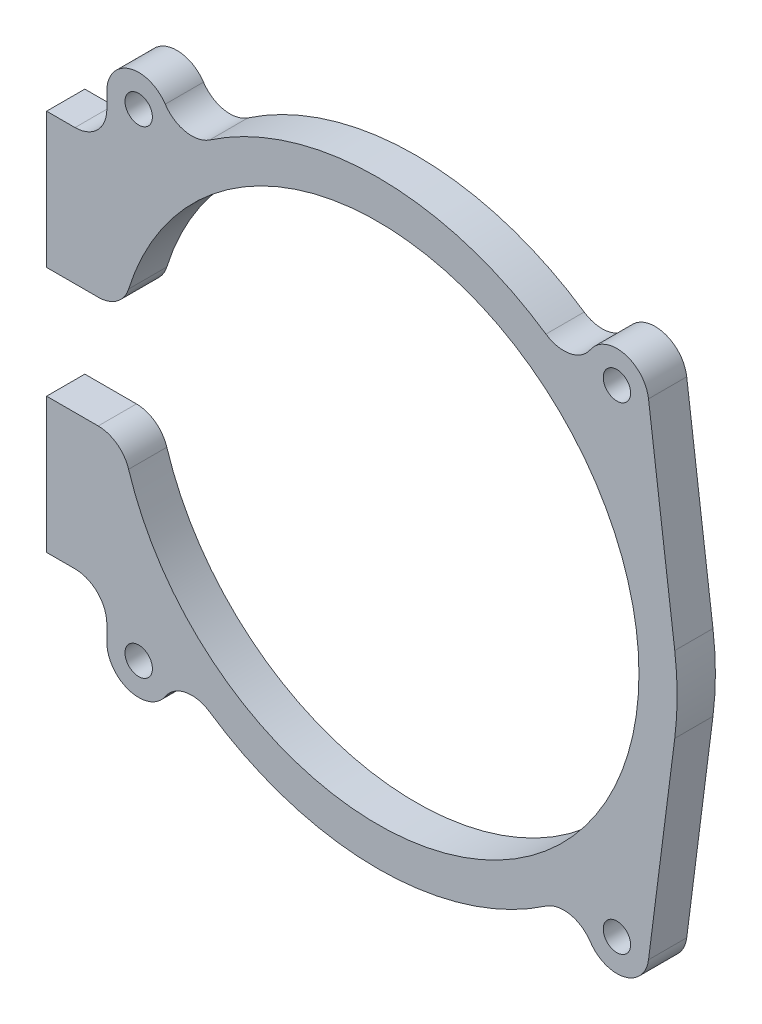
ISO-10303-21;
HEADER;
FILE_DESCRIPTION(('STEP AP214'),'2;1');
FILE_NAME('part.step','',(''),(''),'','','');
FILE_SCHEMA(('AUTOMOTIVE_DESIGN { 1 0 10303 214 1 1 1 1 }'));
ENDSEC;
DATA;
#1=APPLICATION_CONTEXT('core data for automotive mechanical design processes');
#2=APPLICATION_PROTOCOL_DEFINITION('international standard','automotive_design',2000,#1);
#3=PRODUCT_CONTEXT('',#1,'mechanical');
#4=PRODUCT('Part','Part','',(#3));
#5=PRODUCT_RELATED_PRODUCT_CATEGORY('part','',(#4));
#6=PRODUCT_DEFINITION_FORMATION('','',#4);
#7=PRODUCT_DEFINITION_CONTEXT('part definition',#1,'design');
#8=PRODUCT_DEFINITION('design','',#6,#7);
#9=PRODUCT_DEFINITION_SHAPE('','',#8);
#10=(LENGTH_UNIT() NAMED_UNIT(*) SI_UNIT(.MILLI.,.METRE.));
#11=(NAMED_UNIT(*) PLANE_ANGLE_UNIT() SI_UNIT($,.RADIAN.));
#12=(NAMED_UNIT(*) SI_UNIT($,.STERADIAN.) SOLID_ANGLE_UNIT());
#13=UNCERTAINTY_MEASURE_WITH_UNIT(LENGTH_MEASURE(1.E-05),#10,'distance_accuracy_value','');
#14=(GEOMETRIC_REPRESENTATION_CONTEXT(3) GLOBAL_UNCERTAINTY_ASSIGNED_CONTEXT((#13)) GLOBAL_UNIT_ASSIGNED_CONTEXT((#10,
#11,#12)) REPRESENTATION_CONTEXT('',''));
#15=CARTESIAN_POINT('',(0.,0.,0.));
#16=DIRECTION('',(0.,0.,1.));
#17=DIRECTION('',(1.,0.,0.));
#18=AXIS2_PLACEMENT_3D('',#15,#16,#17);
#19=CARTESIAN_POINT('',(-43.8968962456345,-13.75,6.));
#20=DIRECTION('',(0.,0.,-1.));
#21=DIRECTION('',(-1.,0.,0.));
#22=AXIS2_PLACEMENT_3D('',#19,#20,#21);
#23=CYLINDRICAL_SURFACE('',#22,5.);
#24=CARTESIAN_POINT('',(-43.8968962456345,-13.75,0.));
#25=DIRECTION('',(0.,0.,1.));
#26=DIRECTION('',(1.,0.,0.));
#27=AXIS2_PLACEMENT_3D('',#24,#25,#26);
#28=CIRCLE('',#27,5.);
#29=CARTESIAN_POINT('',(-43.8968962456345,-8.75,0.));
#30=VERTEX_POINT('',#29);
#31=CARTESIAN_POINT('',(-39.1254944798047,-12.2554347826087,0.));
#32=VERTEX_POINT('',#31);
#33=EDGE_CURVE('E249',#30,#32,#28,.F.);
#34=ORIENTED_EDGE('',*,*,#33,.F.);
#35=DIRECTION('',(0.,0.,-1.));
#36=VECTOR('',#35,1.);
#37=CARTESIAN_POINT('',(-43.8968962456345,-8.75,6.));
#38=LINE('',#37,#36);
#39=CARTESIAN_POINT('',(-43.8968962456345,-8.75,6.));
#40=VERTEX_POINT('',#39);
#41=EDGE_CURVE('E11',#40,#30,#38,.T.);
#42=ORIENTED_EDGE('',*,*,#41,.F.);
#43=CARTESIAN_POINT('',(-43.8968962456345,-13.75,6.));
#44=DIRECTION('',(0.,0.,1.));
#45=DIRECTION('',(1.,0.,0.));
#46=AXIS2_PLACEMENT_3D('',#43,#44,#45);
#47=CIRCLE('',#46,5.);
#48=CARTESIAN_POINT('',(-39.1254944798047,-12.2554347826087,6.));
#49=VERTEX_POINT('',#48);
#50=EDGE_CURVE('E326',#40,#49,#47,.F.);
#51=ORIENTED_EDGE('',*,*,#50,.T.);
#52=DIRECTION('',(0.,0.,-1.));
#53=VECTOR('',#52,1.);
#54=CARTESIAN_POINT('',(-39.1254944798047,-12.2554347826087,6.));
#55=LINE('',#54,#53);
#56=EDGE_CURVE('E52',#49,#32,#55,.T.);
#57=ORIENTED_EDGE('',*,*,#56,.T.);
#58=EDGE_LOOP('',(#34,#42,#51,#57));
#59=FACE_BOUND('',#58,.T.);
#60=ADVANCED_FACE('F36',(#59),#23,.T.);
#61=CARTESIAN_POINT('',(0.,-8.75,6.));
#62=DIRECTION('',(0.,1.,0.));
#63=DIRECTION('',(0.,0.,1.));
#64=AXIS2_PLACEMENT_3D('',#61,#62,#63);
#65=PLANE('',#64);
#66=DIRECTION('',(1.,0.,0.));
#67=VECTOR('',#66,1.);
#68=CARTESIAN_POINT('',(0.,-8.75,0.));
#69=LINE('',#68,#67);
#70=CARTESIAN_POINT('',(-52.,-8.75,0.));
#71=VERTEX_POINT('',#70);
#72=EDGE_CURVE('E251',#71,#30,#69,.T.);
#73=ORIENTED_EDGE('',*,*,#72,.F.);
#74=DIRECTION('',(0.,0.,-1.));
#75=VECTOR('',#74,1.);
#76=CARTESIAN_POINT('',(-52.,-8.75,6.));
#77=LINE('',#76,#75);
#78=CARTESIAN_POINT('',(-52.,-8.75,6.));
#79=VERTEX_POINT('',#78);
#80=EDGE_CURVE('E44',#79,#71,#77,.T.);
#81=ORIENTED_EDGE('',*,*,#80,.F.);
#82=DIRECTION('',(1.,0.,0.));
#83=VECTOR('',#82,1.);
#84=CARTESIAN_POINT('',(0.,-8.75,6.));
#85=LINE('',#84,#83);
#86=EDGE_CURVE('E394',#79,#40,#85,.T.);
#87=ORIENTED_EDGE('',*,*,#86,.T.);
#88=ORIENTED_EDGE('',*,*,#41,.T.);
#89=EDGE_LOOP('',(#73,#81,#87,#88));
#90=FACE_BOUND('',#89,.T.);
#91=ADVANCED_FACE('F393',(#90),#65,.T.);
#92=CARTESIAN_POINT('',(-52.,0.,6.));
#93=DIRECTION('',(1.,0.,0.));
#94=DIRECTION('',(0.,0.,-1.));
#95=AXIS2_PLACEMENT_3D('',#92,#93,#94);
#96=PLANE('',#95);
#97=DIRECTION('',(0.,-1.,0.));
#98=VECTOR('',#97,1.);
#99=CARTESIAN_POINT('',(-52.,0.,0.));
#100=LINE('',#99,#98);
#101=CARTESIAN_POINT('',(-52.,-30.,0.));
#102=VERTEX_POINT('',#101);
#103=EDGE_CURVE('E254',#71,#102,#100,.T.);
#104=ORIENTED_EDGE('',*,*,#103,.T.);
#105=DIRECTION('',(0.,0.,-1.));
#106=VECTOR('',#105,1.);
#107=CARTESIAN_POINT('',(-52.,-30.,6.));
#108=LINE('',#107,#106);
#109=CARTESIAN_POINT('',(-52.,-30.,6.));
#110=VERTEX_POINT('',#109);
#111=EDGE_CURVE('E377',#110,#102,#108,.T.);
#112=ORIENTED_EDGE('',*,*,#111,.F.);
#113=DIRECTION('',(0.,-1.,0.));
#114=VECTOR('',#113,1.);
#115=CARTESIAN_POINT('',(-52.,0.,6.));
#116=LINE('',#115,#114);
#117=EDGE_CURVE('E383',#79,#110,#116,.T.);
#118=ORIENTED_EDGE('',*,*,#117,.F.);
#119=ORIENTED_EDGE('',*,*,#80,.T.);
#120=EDGE_LOOP('',(#104,#112,#118,#119));
#121=FACE_BOUND('',#120,.T.);
#122=ADVANCED_FACE('F381',(#121),#96,.F.);
#123=CARTESIAN_POINT('',(0.,-30.,6.));
#124=DIRECTION('',(0.,-1.,0.));
#125=DIRECTION('',(0.,0.,-1.));
#126=AXIS2_PLACEMENT_3D('',#123,#124,#125);
#127=PLANE('',#126);
#128=DIRECTION('',(-1.,0.,0.));
#129=VECTOR('',#128,1.);
#130=CARTESIAN_POINT('',(0.,-30.,0.));
#131=LINE('',#130,#129);
#132=CARTESIAN_POINT('',(-47.54,-30.,0.));
#133=VERTEX_POINT('',#132);
#134=EDGE_CURVE('E257',#133,#102,#131,.T.);
#135=ORIENTED_EDGE('',*,*,#134,.F.);
#136=DIRECTION('',(0.,0.,-1.));
#137=VECTOR('',#136,1.);
#138=CARTESIAN_POINT('',(-47.54,-30.,6.));
#139=LINE('',#138,#137);
#140=CARTESIAN_POINT('',(-47.54,-30.,6.));
#141=VERTEX_POINT('',#140);
#142=EDGE_CURVE('E375',#141,#133,#139,.T.);
#143=ORIENTED_EDGE('',*,*,#142,.F.);
#144=DIRECTION('',(-1.,0.,0.));
#145=VECTOR('',#144,1.);
#146=CARTESIAN_POINT('',(0.,-30.,6.));
#147=LINE('',#146,#145);
#148=EDGE_CURVE('E786',#141,#110,#147,.T.);
#149=ORIENTED_EDGE('',*,*,#148,.T.);
#150=ORIENTED_EDGE('',*,*,#111,.T.);
#151=EDGE_LOOP('',(#135,#143,#149,#150));
#152=FACE_BOUND('',#151,.T.);
#153=ADVANCED_FACE('F417',(#152),#127,.T.);
#154=CARTESIAN_POINT('',(-47.54,-35.,6.));
#155=DIRECTION('',(0.,0.,-1.));
#156=DIRECTION('',(-1.,0.,0.));
#157=AXIS2_PLACEMENT_3D('',#154,#155,#156);
#158=CYLINDRICAL_SURFACE('',#157,5.);
#159=CARTESIAN_POINT('',(-47.54,-35.,0.));
#160=DIRECTION('',(0.,0.,1.));
#161=DIRECTION('',(1.,0.,0.));
#162=AXIS2_PLACEMENT_3D('',#159,#160,#161);
#163=CIRCLE('',#162,5.);
#164=CARTESIAN_POINT('',(-42.54,-35.,0.));
#165=VERTEX_POINT('',#164);
#166=EDGE_CURVE('E260',#133,#165,#163,.F.);
#167=ORIENTED_EDGE('',*,*,#166,.T.);
#168=DIRECTION('',(0.,0.,-1.));
#169=VECTOR('',#168,1.);
#170=CARTESIAN_POINT('',(-42.54,-35.,6.));
#171=LINE('',#170,#169);
#172=CARTESIAN_POINT('',(-42.54,-35.,6.));
#173=VERTEX_POINT('',#172);
#174=EDGE_CURVE('E373',#173,#165,#171,.T.);
#175=ORIENTED_EDGE('',*,*,#174,.F.);
#176=CARTESIAN_POINT('',(-47.54,-35.,6.));
#177=DIRECTION('',(0.,0.,1.));
#178=DIRECTION('',(1.,0.,0.));
#179=AXIS2_PLACEMENT_3D('',#176,#177,#178);
#180=CIRCLE('',#179,5.);
#181=EDGE_CURVE('E787',#141,#173,#180,.F.);
#182=ORIENTED_EDGE('',*,*,#181,.F.);
#183=ORIENTED_EDGE('',*,*,#142,.T.);
#184=EDGE_LOOP('',(#167,#175,#182,#183));
#185=FACE_BOUND('',#184,.T.);
#186=ADVANCED_FACE('F422',(#185),#158,.F.);
#187=CARTESIAN_POINT('',(-42.54,0.,6.));
#188=DIRECTION('',(-1.,0.,0.));
#189=DIRECTION('',(0.,0.,1.));
#190=AXIS2_PLACEMENT_3D('',#187,#188,#189);
#191=PLANE('',#190);
#192=DIRECTION('',(0.,1.,0.));
#193=VECTOR('',#192,1.);
#194=CARTESIAN_POINT('',(-42.54,0.,0.));
#195=LINE('',#194,#193);
#196=CARTESIAN_POINT('',(-42.54,-37.5,0.));
#197=VERTEX_POINT('',#196);
#198=EDGE_CURVE('E263',#197,#165,#195,.T.);
#199=ORIENTED_EDGE('',*,*,#198,.F.);
#200=DIRECTION('',(0.,0.,-1.));
#201=VECTOR('',#200,1.);
#202=CARTESIAN_POINT('',(-42.54,-37.5,6.));
#203=LINE('',#202,#201);
#204=CARTESIAN_POINT('',(-42.54,-37.5,6.));
#205=VERTEX_POINT('',#204);
#206=EDGE_CURVE('E371',#205,#197,#203,.T.);
#207=ORIENTED_EDGE('',*,*,#206,.F.);
#208=DIRECTION('',(0.,1.,0.));
#209=VECTOR('',#208,1.);
#210=CARTESIAN_POINT('',(-42.54,0.,6.));
#211=LINE('',#210,#209);
#212=EDGE_CURVE('E781',#205,#173,#211,.T.);
#213=ORIENTED_EDGE('',*,*,#212,.T.);
#214=ORIENTED_EDGE('',*,*,#174,.T.);
#215=EDGE_LOOP('',(#199,#207,#213,#214));
#216=FACE_BOUND('',#215,.T.);
#217=ADVANCED_FACE('F426',(#216),#191,.T.);
#218=CARTESIAN_POINT('',(-37.54,-37.5,6.));
#219=DIRECTION('',(0.,0.,-1.));
#220=DIRECTION('',(-1.,0.,0.));
#221=AXIS2_PLACEMENT_3D('',#218,#219,#220);
#222=CYLINDRICAL_SURFACE('',#221,5.);
#223=CARTESIAN_POINT('',(-37.54,-37.5,0.));
#224=DIRECTION('',(0.,0.,1.));
#225=DIRECTION('',(1.,0.,0.));
#226=AXIS2_PLACEMENT_3D('',#223,#224,#225);
#227=CIRCLE('',#226,5.);
#228=CARTESIAN_POINT('',(-33.3722359848189,-40.262198963464,0.));
#229=VERTEX_POINT('',#228);
#230=EDGE_CURVE('E266',#197,#229,#227,.T.);
#231=ORIENTED_EDGE('',*,*,#230,.T.);
#232=DIRECTION('',(0.,0.,-1.));
#233=VECTOR('',#232,1.);
#234=CARTESIAN_POINT('',(-33.3722359848189,-40.262198963464,6.));
#235=LINE('',#234,#233);
#236=CARTESIAN_POINT('',(-33.3722359848189,-40.262198963464,6.));
#237=VERTEX_POINT('',#236);
#238=EDGE_CURVE('E368',#237,#229,#235,.T.);
#239=ORIENTED_EDGE('',*,*,#238,.F.);
#240=CARTESIAN_POINT('',(-37.54,-37.5,6.));
#241=DIRECTION('',(0.,0.,1.));
#242=DIRECTION('',(1.,0.,0.));
#243=AXIS2_PLACEMENT_3D('',#240,#241,#242);
#244=CIRCLE('',#243,5.);
#245=EDGE_CURVE('E778',#205,#237,#244,.T.);
#246=ORIENTED_EDGE('',*,*,#245,.F.);
#247=ORIENTED_EDGE('',*,*,#206,.T.);
#248=EDGE_LOOP('',(#231,#239,#246,#247));
#249=FACE_BOUND('',#248,.T.);
#250=ADVANCED_FACE('F430',(#249),#222,.T.);
#251=CARTESIAN_POINT('',(-29.2044719696378,-43.0243979269279,6.));
#252=DIRECTION('',(0.,0.,-1.));
#253=DIRECTION('',(-1.,0.,0.));
#254=AXIS2_PLACEMENT_3D('',#251,#252,#253);
#255=CYLINDRICAL_SURFACE('',#254,5.);
#256=CARTESIAN_POINT('',(-29.2044719696378,-43.0243979269279,0.));
#257=DIRECTION('',(0.,0.,1.));
#258=DIRECTION('',(1.,0.,0.));
#259=AXIS2_PLACEMENT_3D('',#256,#257,#258);
#260=CIRCLE('',#259,5.);
#261=CARTESIAN_POINT('',(-26.3963496648649,-38.8874365878002,0.));
#262=VERTEX_POINT('',#261);
#263=EDGE_CURVE('E268',#229,#262,#260,.F.);
#264=ORIENTED_EDGE('',*,*,#263,.T.);
#265=DIRECTION('',(0.,0.,-1.));
#266=VECTOR('',#265,1.);
#267=CARTESIAN_POINT('',(-26.3963496648649,-38.8874365878002,6.));
#268=LINE('',#267,#266);
#269=CARTESIAN_POINT('',(-26.3963496648649,-38.8874365878002,6.));
#270=VERTEX_POINT('',#269);
#271=EDGE_CURVE('E365',#270,#262,#268,.T.);
#272=ORIENTED_EDGE('',*,*,#271,.F.);
#273=CARTESIAN_POINT('',(-29.2044719696378,-43.0243979269279,6.));
#274=DIRECTION('',(0.,0.,1.));
#275=DIRECTION('',(1.,0.,0.));
#276=AXIS2_PLACEMENT_3D('',#273,#274,#275);
#277=CIRCLE('',#276,5.);
#278=EDGE_CURVE('E776',#237,#270,#277,.F.);
#279=ORIENTED_EDGE('',*,*,#278,.F.);
#280=ORIENTED_EDGE('',*,*,#238,.T.);
#281=EDGE_LOOP('',(#264,#272,#279,#280));
#282=FACE_BOUND('',#281,.T.);
#283=ADVANCED_FACE('F434',(#282),#255,.F.);
#284=CARTESIAN_POINT('',(0.,0.,6.));
#285=DIRECTION('',(0.,0.,-1.));
#286=DIRECTION('',(-1.,0.,0.));
#287=AXIS2_PLACEMENT_3D('',#284,#285,#286);
#288=CYLINDRICAL_SURFACE('',#287,47.);
#289=CARTESIAN_POINT('',(0.,0.,0.));
#290=DIRECTION('',(0.,0.,1.));
#291=DIRECTION('',(1.,0.,0.));
#292=AXIS2_PLACEMENT_3D('',#289,#290,#291);
#293=CIRCLE('',#292,47.);
#294=CARTESIAN_POINT('',(26.3963496648649,-38.8874365878002,0.));
#295=VERTEX_POINT('',#294);
#296=EDGE_CURVE('E270',#262,#295,#293,.T.);
#297=ORIENTED_EDGE('',*,*,#296,.T.);
#298=DIRECTION('',(0.,0.,-1.));
#299=VECTOR('',#298,1.);
#300=CARTESIAN_POINT('',(26.3963496648649,-38.8874365878002,6.));
#301=LINE('',#300,#299);
#302=CARTESIAN_POINT('',(26.3963496648649,-38.8874365878002,6.));
#303=VERTEX_POINT('',#302);
#304=EDGE_CURVE('E363',#303,#295,#301,.T.);
#305=ORIENTED_EDGE('',*,*,#304,.F.);
#306=CARTESIAN_POINT('',(0.,0.,6.));
#307=DIRECTION('',(0.,0.,1.));
#308=DIRECTION('',(1.,0.,0.));
#309=AXIS2_PLACEMENT_3D('',#306,#307,#308);
#310=CIRCLE('',#309,47.);
#311=EDGE_CURVE('E796',#270,#303,#310,.T.);
#312=ORIENTED_EDGE('',*,*,#311,.F.);
#313=ORIENTED_EDGE('',*,*,#271,.T.);
#314=EDGE_LOOP('',(#297,#305,#312,#313));
#315=FACE_BOUND('',#314,.T.);
#316=ADVANCED_FACE('F438',(#315),#288,.T.);
#317=CARTESIAN_POINT('',(29.2044719696378,-43.0243979269279,6.));
#318=DIRECTION('',(0.,0.,-1.));
#319=DIRECTION('',(-1.,0.,0.));
#320=AXIS2_PLACEMENT_3D('',#317,#318,#319);
#321=CYLINDRICAL_SURFACE('',#320,5.);
#322=CARTESIAN_POINT('',(29.2044719696378,-43.0243979269279,0.));
#323=DIRECTION('',(0.,0.,1.));
#324=DIRECTION('',(1.,0.,0.));
#325=AXIS2_PLACEMENT_3D('',#322,#323,#324);
#326=CIRCLE('',#325,5.);
#327=CARTESIAN_POINT('',(33.3722359848189,-40.262198963464,0.));
#328=VERTEX_POINT('',#327);
#329=EDGE_CURVE('E273',#328,#295,#326,.T.);
#330=ORIENTED_EDGE('',*,*,#329,.F.);
#331=DIRECTION('',(0.,0.,-1.));
#332=VECTOR('',#331,1.);
#333=CARTESIAN_POINT('',(33.3722359848189,-40.262198963464,6.));
#334=LINE('',#333,#332);
#335=CARTESIAN_POINT('',(33.3722359848189,-40.262198963464,6.));
#336=VERTEX_POINT('',#335);
#337=EDGE_CURVE('E361',#336,#328,#334,.T.);
#338=ORIENTED_EDGE('',*,*,#337,.F.);
#339=CARTESIAN_POINT('',(29.2044719696378,-43.0243979269279,6.));
#340=DIRECTION('',(0.,0.,1.));
#341=DIRECTION('',(1.,0.,0.));
#342=AXIS2_PLACEMENT_3D('',#339,#340,#341);
#343=CIRCLE('',#342,5.);
#344=EDGE_CURVE('E768',#336,#303,#343,.T.);
#345=ORIENTED_EDGE('',*,*,#344,.T.);
#346=ORIENTED_EDGE('',*,*,#304,.T.);
#347=EDGE_LOOP('',(#330,#338,#345,#346));
#348=FACE_BOUND('',#347,.T.);
#349=ADVANCED_FACE('F442',(#348),#321,.F.);
#350=CARTESIAN_POINT('',(37.54,-37.5,6.));
#351=DIRECTION('',(0.,0.,-1.));
#352=DIRECTION('',(-1.,0.,0.));
#353=AXIS2_PLACEMENT_3D('',#350,#351,#352);
#354=CYLINDRICAL_SURFACE('',#353,5.);
#355=CARTESIAN_POINT('',(37.54,-37.5,0.));
#356=DIRECTION('',(0.,0.,1.));
#357=DIRECTION('',(1.,0.,0.));
#358=AXIS2_PLACEMENT_3D('',#355,#356,#357);
#359=CIRCLE('',#358,5.);
#360=CARTESIAN_POINT('',(42.4994847552049,-38.1352251277229,0.));
#361=VERTEX_POINT('',#360);
#362=EDGE_CURVE('E276',#328,#361,#359,.T.);
#363=ORIENTED_EDGE('',*,*,#362,.T.);
#364=DIRECTION('',(0.,0.,-1.));
#365=VECTOR('',#364,1.);
#366=CARTESIAN_POINT('',(42.4994847552049,-38.1352251277229,6.));
#367=LINE('',#366,#365);
#368=CARTESIAN_POINT('',(42.4994847552049,-38.1352251277229,6.));
#369=VERTEX_POINT('',#368);
#370=EDGE_CURVE('E358',#369,#361,#367,.T.);
#371=ORIENTED_EDGE('',*,*,#370,.F.);
#372=CARTESIAN_POINT('',(37.54,-37.5,6.));
#373=DIRECTION('',(0.,0.,1.));
#374=DIRECTION('',(1.,0.,0.));
#375=AXIS2_PLACEMENT_3D('',#372,#373,#374);
#376=CIRCLE('',#375,5.);
#377=EDGE_CURVE('E762',#336,#369,#376,.T.);
#378=ORIENTED_EDGE('',*,*,#377,.F.);
#379=ORIENTED_EDGE('',*,*,#337,.T.);
#380=EDGE_LOOP('',(#363,#371,#378,#379));
#381=FACE_BOUND('',#380,.T.);
#382=ADVANCED_FACE('F446',(#381),#354,.T.);
#383=CARTESIAN_POINT('',(46.6191566989257,-5.97111620059547,6.));
#384=DIRECTION('',(-0.991896951040972,0.127045025544584,0.));
#385=DIRECTION('',(-0.127045025544585,-0.991896951040972,0.));
#386=AXIS2_PLACEMENT_3D('',#383,#384,#385);
#387=PLANE('',#386);
#388=DIRECTION('',(0.127045025544584,0.991896951040972,0.));
#389=VECTOR('',#388,1.);
#390=CARTESIAN_POINT('',(46.6191566989257,-5.97111620059547,0.));
#391=LINE('',#390,#389);
#392=CARTESIAN_POINT('',(46.6191566989257,-5.97111620059547,0.));
#393=VERTEX_POINT('',#392);
#394=EDGE_CURVE('E278',#361,#393,#391,.T.);
#395=ORIENTED_EDGE('',*,*,#394,.T.);
#396=DIRECTION('',(0.,0.,-1.));
#397=VECTOR('',#396,1.);
#398=CARTESIAN_POINT('',(46.6191566989257,-5.97111620059547,6.));
#399=LINE('',#398,#397);
#400=CARTESIAN_POINT('',(46.6191566989257,-5.97111620059547,6.));
#401=VERTEX_POINT('',#400);
#402=EDGE_CURVE('E355',#401,#393,#399,.T.);
#403=ORIENTED_EDGE('',*,*,#402,.F.);
#404=DIRECTION('',(0.127045025544584,0.991896951040972,0.));
#405=VECTOR('',#404,1.);
#406=CARTESIAN_POINT('',(46.6191566989257,-5.97111620059547,6.));
#407=LINE('',#406,#405);
#408=EDGE_CURVE('E759',#369,#401,#407,.T.);
#409=ORIENTED_EDGE('',*,*,#408,.F.);
#410=ORIENTED_EDGE('',*,*,#370,.T.);
#411=EDGE_LOOP('',(#395,#403,#409,#410));
#412=FACE_BOUND('',#411,.T.);
#413=ADVANCED_FACE('F450',(#412),#387,.F.);
#414=CARTESIAN_POINT('',(0.,0.,6.));
#415=DIRECTION('',(0.,0.,-1.));
#416=DIRECTION('',(-1.,0.,0.));
#417=AXIS2_PLACEMENT_3D('',#414,#415,#416);
#418=CYLINDRICAL_SURFACE('',#417,47.);
#419=CARTESIAN_POINT('',(0.,0.,0.));
#420=DIRECTION('',(0.,0.,1.));
#421=DIRECTION('',(1.,0.,0.));
#422=AXIS2_PLACEMENT_3D('',#419,#420,#421);
#423=CIRCLE('',#422,47.);
#424=CARTESIAN_POINT('',(46.6191566989257,5.97111620059547,0.));
#425=VERTEX_POINT('',#424);
#426=EDGE_CURVE('E280',#393,#425,#423,.T.);
#427=ORIENTED_EDGE('',*,*,#426,.T.);
#428=DIRECTION('',(0.,0.,-1.));
#429=VECTOR('',#428,1.);
#430=CARTESIAN_POINT('',(46.6191566989257,5.97111620059547,6.));
#431=LINE('',#430,#429);
#432=CARTESIAN_POINT('',(46.6191566989257,5.97111620059547,6.));
#433=VERTEX_POINT('',#432);
#434=EDGE_CURVE('E353',#433,#425,#431,.T.);
#435=ORIENTED_EDGE('',*,*,#434,.F.);
#436=CARTESIAN_POINT('',(0.,0.,6.));
#437=DIRECTION('',(0.,0.,1.));
#438=DIRECTION('',(1.,0.,0.));
#439=AXIS2_PLACEMENT_3D('',#436,#437,#438);
#440=CIRCLE('',#439,47.);
#441=EDGE_CURVE('E757',#401,#433,#440,.T.);
#442=ORIENTED_EDGE('',*,*,#441,.F.);
#443=ORIENTED_EDGE('',*,*,#402,.T.);
#444=EDGE_LOOP('',(#427,#435,#442,#443));
#445=FACE_BOUND('',#444,.T.);
#446=ADVANCED_FACE('F454',(#445),#418,.T.);
#447=CARTESIAN_POINT('',(46.6191566989257,5.97111620059548,6.));
#448=DIRECTION('',(0.991896951040972,0.127045025544585,0.));
#449=DIRECTION('',(-0.127045025544585,0.991896951040972,0.));
#450=AXIS2_PLACEMENT_3D('',#447,#448,#449);
#451=PLANE('',#450);
#452=DIRECTION('',(0.127045025544585,-0.991896951040972,0.));
#453=VECTOR('',#452,1.);
#454=CARTESIAN_POINT('',(46.6191566989257,5.97111620059548,0.));
#455=LINE('',#454,#453);
#456=CARTESIAN_POINT('',(42.4994847552049,38.1352251277229,0.));
#457=VERTEX_POINT('',#456);
#458=EDGE_CURVE('E283',#457,#425,#455,.T.);
#459=ORIENTED_EDGE('',*,*,#458,.F.);
#460=DIRECTION('',(0.,0.,-1.));
#461=VECTOR('',#460,1.);
#462=CARTESIAN_POINT('',(42.4994847552049,38.1352251277229,6.));
#463=LINE('',#462,#461);
#464=CARTESIAN_POINT('',(42.4994847552049,38.1352251277229,6.));
#465=VERTEX_POINT('',#464);
#466=EDGE_CURVE('E351',#465,#457,#463,.T.);
#467=ORIENTED_EDGE('',*,*,#466,.F.);
#468=DIRECTION('',(0.127045025544585,-0.991896951040972,0.));
#469=VECTOR('',#468,1.);
#470=CARTESIAN_POINT('',(46.6191566989257,5.97111620059548,6.));
#471=LINE('',#470,#469);
#472=EDGE_CURVE('E750',#465,#433,#471,.T.);
#473=ORIENTED_EDGE('',*,*,#472,.T.);
#474=ORIENTED_EDGE('',*,*,#434,.T.);
#475=EDGE_LOOP('',(#459,#467,#473,#474));
#476=FACE_BOUND('',#475,.T.);
#477=ADVANCED_FACE('F458',(#476),#451,.T.);
#478=CARTESIAN_POINT('',(37.54,37.5,6.));
#479=DIRECTION('',(0.,0.,-1.));
#480=DIRECTION('',(-1.,0.,0.));
#481=AXIS2_PLACEMENT_3D('',#478,#479,#480);
#482=CYLINDRICAL_SURFACE('',#481,5.);
#483=CARTESIAN_POINT('',(37.54,37.5,0.));
#484=DIRECTION('',(0.,0.,1.));
#485=DIRECTION('',(1.,0.,0.));
#486=AXIS2_PLACEMENT_3D('',#483,#484,#485);
#487=CIRCLE('',#486,5.);
#488=CARTESIAN_POINT('',(33.3722359848189,40.262198963464,0.));
#489=VERTEX_POINT('',#488);
#490=EDGE_CURVE('E286',#457,#489,#487,.T.);
#491=ORIENTED_EDGE('',*,*,#490,.T.);
#492=DIRECTION('',(0.,0.,-1.));
#493=VECTOR('',#492,1.);
#494=CARTESIAN_POINT('',(33.3722359848189,40.262198963464,6.));
#495=LINE('',#494,#493);
#496=CARTESIAN_POINT('',(33.3722359848189,40.262198963464,6.));
#497=VERTEX_POINT('',#496);
#498=EDGE_CURVE('E348',#497,#489,#495,.T.);
#499=ORIENTED_EDGE('',*,*,#498,.F.);
#500=CARTESIAN_POINT('',(37.54,37.5,6.));
#501=DIRECTION('',(0.,0.,1.));
#502=DIRECTION('',(1.,0.,0.));
#503=AXIS2_PLACEMENT_3D('',#500,#501,#502);
#504=CIRCLE('',#503,5.);
#505=EDGE_CURVE('E747',#465,#497,#504,.T.);
#506=ORIENTED_EDGE('',*,*,#505,.F.);
#507=ORIENTED_EDGE('',*,*,#466,.T.);
#508=EDGE_LOOP('',(#491,#499,#506,#507));
#509=FACE_BOUND('',#508,.T.);
#510=ADVANCED_FACE('F462',(#509),#482,.T.);
#511=CARTESIAN_POINT('',(29.2044719696378,43.0243979269279,6.));
#512=DIRECTION('',(0.,0.,-1.));
#513=DIRECTION('',(-1.,0.,0.));
#514=AXIS2_PLACEMENT_3D('',#511,#512,#513);
#515=CYLINDRICAL_SURFACE('',#514,5.);
#516=CARTESIAN_POINT('',(29.2044719696378,43.0243979269279,0.));
#517=DIRECTION('',(0.,0.,1.));
#518=DIRECTION('',(1.,0.,0.));
#519=AXIS2_PLACEMENT_3D('',#516,#517,#518);
#520=CIRCLE('',#519,5.);
#521=CARTESIAN_POINT('',(26.3963496648649,38.8874365878003,0.));
#522=VERTEX_POINT('',#521);
#523=EDGE_CURVE('E288',#489,#522,#520,.F.);
#524=ORIENTED_EDGE('',*,*,#523,.T.);
#525=DIRECTION('',(0.,0.,-1.));
#526=VECTOR('',#525,1.);
#527=CARTESIAN_POINT('',(26.3963496648649,38.8874365878003,6.));
#528=LINE('',#527,#526);
#529=CARTESIAN_POINT('',(26.3963496648649,38.8874365878003,6.));
#530=VERTEX_POINT('',#529);
#531=EDGE_CURVE('E345',#530,#522,#528,.T.);
#532=ORIENTED_EDGE('',*,*,#531,.F.);
#533=CARTESIAN_POINT('',(29.2044719696378,43.0243979269279,6.));
#534=DIRECTION('',(0.,0.,1.));
#535=DIRECTION('',(1.,0.,0.));
#536=AXIS2_PLACEMENT_3D('',#533,#534,#535);
#537=CIRCLE('',#536,5.);
#538=EDGE_CURVE('E745',#497,#530,#537,.F.);
#539=ORIENTED_EDGE('',*,*,#538,.F.);
#540=ORIENTED_EDGE('',*,*,#498,.T.);
#541=EDGE_LOOP('',(#524,#532,#539,#540));
#542=FACE_BOUND('',#541,.T.);
#543=ADVANCED_FACE('F466',(#542),#515,.F.);
#544=CARTESIAN_POINT('',(0.,0.,6.));
#545=DIRECTION('',(0.,0.,-1.));
#546=DIRECTION('',(-1.,0.,0.));
#547=AXIS2_PLACEMENT_3D('',#544,#545,#546);
#548=CYLINDRICAL_SURFACE('',#547,47.);
#549=CARTESIAN_POINT('',(0.,0.,0.));
#550=DIRECTION('',(0.,0.,1.));
#551=DIRECTION('',(1.,0.,0.));
#552=AXIS2_PLACEMENT_3D('',#549,#550,#551);
#553=CIRCLE('',#552,47.);
#554=CARTESIAN_POINT('',(-26.3963496648649,38.8874365878003,0.));
#555=VERTEX_POINT('',#554);
#556=EDGE_CURVE('E290',#522,#555,#553,.T.);
#557=ORIENTED_EDGE('',*,*,#556,.T.);
#558=DIRECTION('',(0.,0.,-1.));
#559=VECTOR('',#558,1.);
#560=CARTESIAN_POINT('',(-26.3963496648649,38.8874365878003,6.));
#561=LINE('',#560,#559);
#562=CARTESIAN_POINT('',(-26.3963496648649,38.8874365878003,6.));
#563=VERTEX_POINT('',#562);
#564=EDGE_CURVE('E343',#563,#555,#561,.T.);
#565=ORIENTED_EDGE('',*,*,#564,.F.);
#566=CARTESIAN_POINT('',(0.,0.,6.));
#567=DIRECTION('',(0.,0.,1.));
#568=DIRECTION('',(1.,0.,0.));
#569=AXIS2_PLACEMENT_3D('',#566,#567,#568);
#570=CIRCLE('',#569,47.);
#571=EDGE_CURVE('E805',#530,#563,#570,.T.);
#572=ORIENTED_EDGE('',*,*,#571,.F.);
#573=ORIENTED_EDGE('',*,*,#531,.T.);
#574=EDGE_LOOP('',(#557,#565,#572,#573));
#575=FACE_BOUND('',#574,.T.);
#576=ADVANCED_FACE('F470',(#575),#548,.T.);
#577=CARTESIAN_POINT('',(-29.2044719696378,43.0243979269279,6.));
#578=DIRECTION('',(0.,0.,-1.));
#579=DIRECTION('',(-1.,0.,0.));
#580=AXIS2_PLACEMENT_3D('',#577,#578,#579);
#581=CYLINDRICAL_SURFACE('',#580,5.);
#582=CARTESIAN_POINT('',(-29.2044719696378,43.0243979269279,0.));
#583=DIRECTION('',(0.,0.,1.));
#584=DIRECTION('',(1.,0.,0.));
#585=AXIS2_PLACEMENT_3D('',#582,#583,#584);
#586=CIRCLE('',#585,5.);
#587=CARTESIAN_POINT('',(-33.3722359848189,40.262198963464,0.));
#588=VERTEX_POINT('',#587);
#589=EDGE_CURVE('E293',#588,#555,#586,.T.);
#590=ORIENTED_EDGE('',*,*,#589,.F.);
#591=DIRECTION('',(0.,0.,-1.));
#592=VECTOR('',#591,1.);
#593=CARTESIAN_POINT('',(-33.3722359848189,40.262198963464,6.));
#594=LINE('',#593,#592);
#595=CARTESIAN_POINT('',(-33.3722359848189,40.262198963464,6.));
#596=VERTEX_POINT('',#595);
#597=EDGE_CURVE('E341',#596,#588,#594,.T.);
#598=ORIENTED_EDGE('',*,*,#597,.F.);
#599=CARTESIAN_POINT('',(-29.2044719696378,43.0243979269279,6.));
#600=DIRECTION('',(0.,0.,1.));
#601=DIRECTION('',(1.,0.,0.));
#602=AXIS2_PLACEMENT_3D('',#599,#600,#601);
#603=CIRCLE('',#602,5.);
#604=EDGE_CURVE('E737',#596,#563,#603,.T.);
#605=ORIENTED_EDGE('',*,*,#604,.T.);
#606=ORIENTED_EDGE('',*,*,#564,.T.);
#607=EDGE_LOOP('',(#590,#598,#605,#606));
#608=FACE_BOUND('',#607,.T.);
#609=ADVANCED_FACE('F474',(#608),#581,.F.);
#610=CARTESIAN_POINT('',(-37.54,37.5,6.));
#611=DIRECTION('',(0.,0.,-1.));
#612=DIRECTION('',(-1.,0.,0.));
#613=AXIS2_PLACEMENT_3D('',#610,#611,#612);
#614=CYLINDRICAL_SURFACE('',#613,5.);
#615=CARTESIAN_POINT('',(-37.54,37.5,0.));
#616=DIRECTION('',(0.,0.,1.));
#617=DIRECTION('',(1.,0.,0.));
#618=AXIS2_PLACEMENT_3D('',#615,#616,#617);
#619=CIRCLE('',#618,5.);
#620=CARTESIAN_POINT('',(-42.54,37.5,0.));
#621=VERTEX_POINT('',#620);
#622=EDGE_CURVE('E296',#588,#621,#619,.T.);
#623=ORIENTED_EDGE('',*,*,#622,.T.);
#624=DIRECTION('',(0.,0.,-1.));
#625=VECTOR('',#624,1.);
#626=CARTESIAN_POINT('',(-42.54,37.5,6.));
#627=LINE('',#626,#625);
#628=CARTESIAN_POINT('',(-42.54,37.5,6.));
#629=VERTEX_POINT('',#628);
#630=EDGE_CURVE('E338',#629,#621,#627,.T.);
#631=ORIENTED_EDGE('',*,*,#630,.F.);
#632=CARTESIAN_POINT('',(-37.54,37.5,6.));
#633=DIRECTION('',(0.,0.,1.));
#634=DIRECTION('',(1.,0.,0.));
#635=AXIS2_PLACEMENT_3D('',#632,#633,#634);
#636=CIRCLE('',#635,5.);
#637=EDGE_CURVE('E808',#596,#629,#636,.T.);
#638=ORIENTED_EDGE('',*,*,#637,.F.);
#639=ORIENTED_EDGE('',*,*,#597,.T.);
#640=EDGE_LOOP('',(#623,#631,#638,#639));
#641=FACE_BOUND('',#640,.T.);
#642=ADVANCED_FACE('F478',(#641),#614,.T.);
#643=CARTESIAN_POINT('',(-42.54,0.,6.));
#644=DIRECTION('',(1.,0.,0.));
#645=DIRECTION('',(0.,0.,-1.));
#646=AXIS2_PLACEMENT_3D('',#643,#644,#645);
#647=PLANE('',#646);
#648=DIRECTION('',(0.,-1.,0.));
#649=VECTOR('',#648,1.);
#650=CARTESIAN_POINT('',(-42.54,0.,0.));
#651=LINE('',#650,#649);
#652=CARTESIAN_POINT('',(-42.54,35.,0.));
#653=VERTEX_POINT('',#652);
#654=EDGE_CURVE('E298',#621,#653,#651,.T.);
#655=ORIENTED_EDGE('',*,*,#654,.T.);
#656=DIRECTION('',(0.,0.,-1.));
#657=VECTOR('',#656,1.);
#658=CARTESIAN_POINT('',(-42.54,35.,6.));
#659=LINE('',#658,#657);
#660=CARTESIAN_POINT('',(-42.54,35.,6.));
#661=VERTEX_POINT('',#660);
#662=EDGE_CURVE('E335',#661,#653,#659,.T.);
#663=ORIENTED_EDGE('',*,*,#662,.F.);
#664=DIRECTION('',(0.,-1.,0.));
#665=VECTOR('',#664,1.);
#666=CARTESIAN_POINT('',(-42.54,0.,6.));
#667=LINE('',#666,#665);
#668=EDGE_CURVE('E728',#629,#661,#667,.T.);
#669=ORIENTED_EDGE('',*,*,#668,.F.);
#670=ORIENTED_EDGE('',*,*,#630,.T.);
#671=EDGE_LOOP('',(#655,#663,#669,#670));
#672=FACE_BOUND('',#671,.T.);
#673=ADVANCED_FACE('F482',(#672),#647,.F.);
#674=CARTESIAN_POINT('',(-47.54,35.,6.));
#675=DIRECTION('',(0.,0.,-1.));
#676=DIRECTION('',(-1.,0.,0.));
#677=AXIS2_PLACEMENT_3D('',#674,#675,#676);
#678=CYLINDRICAL_SURFACE('',#677,5.);
#679=CARTESIAN_POINT('',(-47.54,35.,0.));
#680=DIRECTION('',(0.,0.,1.));
#681=DIRECTION('',(1.,0.,0.));
#682=AXIS2_PLACEMENT_3D('',#679,#680,#681);
#683=CIRCLE('',#682,5.);
#684=CARTESIAN_POINT('',(-47.54,30.,0.));
#685=VERTEX_POINT('',#684);
#686=EDGE_CURVE('E300',#653,#685,#683,.F.);
#687=ORIENTED_EDGE('',*,*,#686,.T.);
#688=DIRECTION('',(0.,0.,-1.));
#689=VECTOR('',#688,1.);
#690=CARTESIAN_POINT('',(-47.54,30.,6.));
#691=LINE('',#690,#689);
#692=CARTESIAN_POINT('',(-47.54,30.,6.));
#693=VERTEX_POINT('',#692);
#694=EDGE_CURVE('E332',#693,#685,#691,.T.);
#695=ORIENTED_EDGE('',*,*,#694,.F.);
#696=CARTESIAN_POINT('',(-47.54,35.,6.));
#697=DIRECTION('',(0.,0.,1.));
#698=DIRECTION('',(1.,0.,0.));
#699=AXIS2_PLACEMENT_3D('',#696,#697,#698);
#700=CIRCLE('',#699,5.);
#701=EDGE_CURVE('E725',#661,#693,#700,.F.);
#702=ORIENTED_EDGE('',*,*,#701,.F.);
#703=ORIENTED_EDGE('',*,*,#662,.T.);
#704=EDGE_LOOP('',(#687,#695,#702,#703));
#705=FACE_BOUND('',#704,.T.);
#706=ADVANCED_FACE('F486',(#705),#678,.F.);
#707=CARTESIAN_POINT('',(0.,30.,6.));
#708=DIRECTION('',(0.,-1.,0.));
#709=DIRECTION('',(0.,0.,-1.));
#710=AXIS2_PLACEMENT_3D('',#707,#708,#709);
#711=PLANE('',#710);
#712=DIRECTION('',(-1.,0.,0.));
#713=VECTOR('',#712,1.);
#714=CARTESIAN_POINT('',(0.,30.,0.));
#715=LINE('',#714,#713);
#716=CARTESIAN_POINT('',(-52.,30.,0.));
#717=VERTEX_POINT('',#716);
#718=EDGE_CURVE('E302',#685,#717,#715,.T.);
#719=ORIENTED_EDGE('',*,*,#718,.T.);
#720=DIRECTION('',(0.,0.,-1.));
#721=VECTOR('',#720,1.);
#722=CARTESIAN_POINT('',(-52.,30.,6.));
#723=LINE('',#722,#721);
#724=CARTESIAN_POINT('',(-52.,30.,6.));
#725=VERTEX_POINT('',#724);
#726=EDGE_CURVE('E330',#725,#717,#723,.T.);
#727=ORIENTED_EDGE('',*,*,#726,.F.);
#728=DIRECTION('',(-1.,0.,0.));
#729=VECTOR('',#728,1.);
#730=CARTESIAN_POINT('',(0.,30.,6.));
#731=LINE('',#730,#729);
#732=EDGE_CURVE('E723',#693,#725,#731,.T.);
#733=ORIENTED_EDGE('',*,*,#732,.F.);
#734=ORIENTED_EDGE('',*,*,#694,.T.);
#735=EDGE_LOOP('',(#719,#727,#733,#734));
#736=FACE_BOUND('',#735,.T.);
#737=ADVANCED_FACE('F490',(#736),#711,.F.);
#738=CARTESIAN_POINT('',(-52.,0.,6.));
#739=DIRECTION('',(-1.,0.,0.));
#740=DIRECTION('',(0.,0.,1.));
#741=AXIS2_PLACEMENT_3D('',#738,#739,#740);
#742=PLANE('',#741);
#743=DIRECTION('',(0.,1.,0.));
#744=VECTOR('',#743,1.);
#745=CARTESIAN_POINT('',(-52.,0.,0.));
#746=LINE('',#745,#744);
#747=CARTESIAN_POINT('',(-52.,8.75,0.));
#748=VERTEX_POINT('',#747);
#749=EDGE_CURVE('E305',#748,#717,#746,.T.);
#750=ORIENTED_EDGE('',*,*,#749,.F.);
#751=DIRECTION('',(0.,0.,-1.));
#752=VECTOR('',#751,1.);
#753=CARTESIAN_POINT('',(-52.,8.75,6.));
#754=LINE('',#753,#752);
#755=CARTESIAN_POINT('',(-52.,8.75,6.));
#756=VERTEX_POINT('',#755);
#757=EDGE_CURVE('E229',#756,#748,#754,.T.);
#758=ORIENTED_EDGE('',*,*,#757,.F.);
#759=DIRECTION('',(0.,1.,0.));
#760=VECTOR('',#759,1.);
#761=CARTESIAN_POINT('',(-52.,0.,6.));
#762=LINE('',#761,#760);
#763=EDGE_CURVE('E219',#756,#725,#762,.T.);
#764=ORIENTED_EDGE('',*,*,#763,.T.);
#765=ORIENTED_EDGE('',*,*,#726,.T.);
#766=EDGE_LOOP('',(#750,#758,#764,#765));
#767=FACE_BOUND('',#766,.T.);
#768=ADVANCED_FACE('F494',(#767),#742,.T.);
#769=CARTESIAN_POINT('',(0.,8.75,6.));
#770=DIRECTION('',(0.,1.,0.));
#771=DIRECTION('',(0.,0.,1.));
#772=AXIS2_PLACEMENT_3D('',#769,#770,#771);
#773=PLANE('',#772);
#774=DIRECTION('',(1.,0.,0.));
#775=VECTOR('',#774,1.);
#776=CARTESIAN_POINT('',(0.,8.75,0.));
#777=LINE('',#776,#775);
#778=CARTESIAN_POINT('',(-43.8968962456345,8.75,0.));
#779=VERTEX_POINT('',#778);
#780=EDGE_CURVE('E226',#748,#779,#777,.T.);
#781=ORIENTED_EDGE('',*,*,#780,.T.);
#782=DIRECTION('',(0.,0.,-1.));
#783=VECTOR('',#782,1.);
#784=CARTESIAN_POINT('',(-43.8968962456345,8.75,6.));
#785=LINE('',#784,#783);
#786=CARTESIAN_POINT('',(-43.8968962456345,8.75,6.));
#787=VERTEX_POINT('',#786);
#788=EDGE_CURVE('E223',#787,#779,#785,.T.);
#789=ORIENTED_EDGE('',*,*,#788,.F.);
#790=DIRECTION('',(1.,0.,0.));
#791=VECTOR('',#790,1.);
#792=CARTESIAN_POINT('',(0.,8.75,6.));
#793=LINE('',#792,#791);
#794=EDGE_CURVE('E211',#756,#787,#793,.T.);
#795=ORIENTED_EDGE('',*,*,#794,.F.);
#796=ORIENTED_EDGE('',*,*,#757,.T.);
#797=EDGE_LOOP('',(#781,#789,#795,#796));
#798=FACE_BOUND('',#797,.T.);
#799=ADVANCED_FACE('F224',(#798),#773,.F.);
#800=CARTESIAN_POINT('',(-43.8968962456345,13.75,6.));
#801=DIRECTION('',(0.,0.,-1.));
#802=DIRECTION('',(-1.,0.,0.));
#803=AXIS2_PLACEMENT_3D('',#800,#801,#802);
#804=CYLINDRICAL_SURFACE('',#803,5.);
#805=CARTESIAN_POINT('',(-43.8968962456345,13.75,0.));
#806=DIRECTION('',(0.,0.,1.));
#807=DIRECTION('',(1.,0.,0.));
#808=AXIS2_PLACEMENT_3D('',#805,#806,#807);
#809=CIRCLE('',#808,5.);
#810=CARTESIAN_POINT('',(-39.1254944798047,12.2554347826087,0.));
#811=VERTEX_POINT('',#810);
#812=EDGE_CURVE('E309',#779,#811,#809,.T.);
#813=ORIENTED_EDGE('',*,*,#812,.T.);
#814=DIRECTION('',(0.,0.,-1.));
#815=VECTOR('',#814,1.);
#816=CARTESIAN_POINT('',(-39.1254944798047,12.2554347826087,6.));
#817=LINE('',#816,#815);
#818=CARTESIAN_POINT('',(-39.1254944798047,12.2554347826087,6.));
#819=VERTEX_POINT('',#818);
#820=EDGE_CURVE('E132',#819,#811,#817,.T.);
#821=ORIENTED_EDGE('',*,*,#820,.F.);
#822=CARTESIAN_POINT('',(-43.8968962456345,13.75,6.));
#823=DIRECTION('',(0.,0.,1.));
#824=DIRECTION('',(1.,0.,0.));
#825=AXIS2_PLACEMENT_3D('',#822,#823,#824);
#826=CIRCLE('',#825,5.);
#827=EDGE_CURVE('E217',#787,#819,#826,.T.);
#828=ORIENTED_EDGE('',*,*,#827,.F.);
#829=ORIENTED_EDGE('',*,*,#788,.T.);
#830=EDGE_LOOP('',(#813,#821,#828,#829));
#831=FACE_BOUND('',#830,.T.);
#832=ADVANCED_FACE('F231',(#831),#804,.T.);
#833=CARTESIAN_POINT('',(-37.54,37.5,6.));
#834=DIRECTION('',(0.,0.,-1.));
#835=DIRECTION('',(-1.,0.,0.));
#836=AXIS2_PLACEMENT_3D('',#833,#834,#835);
#837=CYLINDRICAL_SURFACE('',#836,2.15);
#838=CARTESIAN_POINT('',(-37.54,37.5,6.));
#839=DIRECTION('',(0.,0.,1.));
#840=DIRECTION('',(1.,0.,0.));
#841=AXIS2_PLACEMENT_3D('',#838,#839,#840);
#842=CIRCLE('',#841,2.15);
#843=CARTESIAN_POINT('',(-35.39,37.5,6.));
#844=VERTEX_POINT('',#843);
#845=EDGE_CURVE('E243',#844,#844,#842,.T.);
#846=ORIENTED_EDGE('',*,*,#845,.T.);
#847=EDGE_LOOP('',(#846));
#848=FACE_BOUND('',#847,.T.);
#849=CARTESIAN_POINT('',(-37.54,37.5,0.));
#850=DIRECTION('',(0.,0.,1.));
#851=DIRECTION('',(1.,0.,0.));
#852=AXIS2_PLACEMENT_3D('',#849,#850,#851);
#853=CIRCLE('',#852,2.15);
#854=CARTESIAN_POINT('',(-35.39,37.5,0.));
#855=VERTEX_POINT('',#854);
#856=EDGE_CURVE('E320',#855,#855,#853,.T.);
#857=ORIENTED_EDGE('',*,*,#856,.F.);
#858=EDGE_LOOP('',(#857));
#859=FACE_BOUND('',#858,.T.);
#860=ADVANCED_FACE('F501',(#848,#859),#837,.F.);
#861=CARTESIAN_POINT('',(-37.54,-37.5,6.));
#862=DIRECTION('',(0.,0.,-1.));
#863=DIRECTION('',(-1.,0.,0.));
#864=AXIS2_PLACEMENT_3D('',#861,#862,#863);
#865=CYLINDRICAL_SURFACE('',#864,2.15);
#866=CARTESIAN_POINT('',(-37.54,-37.5,6.));
#867=DIRECTION('',(0.,0.,1.));
#868=DIRECTION('',(1.,0.,0.));
#869=AXIS2_PLACEMENT_3D('',#866,#867,#868);
#870=CIRCLE('',#869,2.15);
#871=CARTESIAN_POINT('',(-35.39,-37.5,6.));
#872=VERTEX_POINT('',#871);
#873=EDGE_CURVE('E240',#872,#872,#870,.T.);
#874=ORIENTED_EDGE('',*,*,#873,.T.);
#875=EDGE_LOOP('',(#874));
#876=FACE_BOUND('',#875,.T.);
#877=CARTESIAN_POINT('',(-37.54,-37.5,0.));
#878=DIRECTION('',(0.,0.,1.));
#879=DIRECTION('',(1.,0.,0.));
#880=AXIS2_PLACEMENT_3D('',#877,#878,#879);
#881=CIRCLE('',#880,2.15);
#882=CARTESIAN_POINT('',(-35.39,-37.5,0.));
#883=VERTEX_POINT('',#882);
#884=EDGE_CURVE('E317',#883,#883,#881,.T.);
#885=ORIENTED_EDGE('',*,*,#884,.F.);
#886=EDGE_LOOP('',(#885));
#887=FACE_BOUND('',#886,.T.);
#888=ADVANCED_FACE('F406',(#876,#887),#865,.F.);
#889=CARTESIAN_POINT('',(37.54,-37.5,6.));
#890=DIRECTION('',(0.,0.,-1.));
#891=DIRECTION('',(-1.,0.,0.));
#892=AXIS2_PLACEMENT_3D('',#889,#890,#891);
#893=CYLINDRICAL_SURFACE('',#892,2.15);
#894=CARTESIAN_POINT('',(37.54,-37.5,6.));
#895=DIRECTION('',(0.,0.,1.));
#896=DIRECTION('',(1.,0.,0.));
#897=AXIS2_PLACEMENT_3D('',#894,#895,#896);
#898=CIRCLE('',#897,2.15);
#899=CARTESIAN_POINT('',(39.69,-37.5,6.));
#900=VERTEX_POINT('',#899);
#901=EDGE_CURVE('E234',#900,#900,#898,.F.);
#902=ORIENTED_EDGE('',*,*,#901,.F.);
#903=EDGE_LOOP('',(#902));
#904=FACE_BOUND('',#903,.T.);
#905=CARTESIAN_POINT('',(37.54,-37.5,0.));
#906=DIRECTION('',(0.,0.,1.));
#907=DIRECTION('',(1.,0.,0.));
#908=AXIS2_PLACEMENT_3D('',#905,#906,#907);
#909=CIRCLE('',#908,2.15);
#910=CARTESIAN_POINT('',(39.69,-37.5,0.));
#911=VERTEX_POINT('',#910);
#912=EDGE_CURVE('E314',#911,#911,#909,.F.);
#913=ORIENTED_EDGE('',*,*,#912,.T.);
#914=EDGE_LOOP('',(#913));
#915=FACE_BOUND('',#914,.T.);
#916=ADVANCED_FACE('F398',(#904,#915),#893,.F.);
#917=CARTESIAN_POINT('',(0.,0.,6.));
#918=DIRECTION('',(0.,0.,-1.));
#919=DIRECTION('',(-1.,0.,0.));
#920=AXIS2_PLACEMENT_3D('',#917,#918,#919);
#921=CYLINDRICAL_SURFACE('',#920,41.);
#922=CARTESIAN_POINT('',(0.,0.,0.));
#923=DIRECTION('',(0.,0.,1.));
#924=DIRECTION('',(1.,0.,0.));
#925=AXIS2_PLACEMENT_3D('',#922,#923,#924);
#926=CIRCLE('',#925,41.);
#927=EDGE_CURVE('E311',#32,#811,#926,.T.);
#928=ORIENTED_EDGE('',*,*,#927,.F.);
#929=ORIENTED_EDGE('',*,*,#56,.F.);
#930=CARTESIAN_POINT('',(0.,0.,6.));
#931=DIRECTION('',(0.,0.,1.));
#932=DIRECTION('',(1.,0.,0.));
#933=AXIS2_PLACEMENT_3D('',#930,#931,#932);
#934=CIRCLE('',#933,41.);
#935=EDGE_CURVE('E232',#49,#819,#934,.T.);
#936=ORIENTED_EDGE('',*,*,#935,.T.);
#937=ORIENTED_EDGE('',*,*,#820,.T.);
#938=EDGE_LOOP('',(#928,#929,#936,#937));
#939=FACE_BOUND('',#938,.T.);
#940=ADVANCED_FACE('F395',(#939),#921,.F.);
#941=CARTESIAN_POINT('',(37.54,37.5,6.));
#942=DIRECTION('',(0.,0.,-1.));
#943=DIRECTION('',(-1.,0.,0.));
#944=AXIS2_PLACEMENT_3D('',#941,#942,#943);
#945=CYLINDRICAL_SURFACE('',#944,2.15);
#946=CARTESIAN_POINT('',(37.54,37.5,6.));
#947=DIRECTION('',(0.,0.,1.));
#948=DIRECTION('',(1.,0.,0.));
#949=AXIS2_PLACEMENT_3D('',#946,#947,#948);
#950=CIRCLE('',#949,2.15);
#951=CARTESIAN_POINT('',(39.69,37.5,6.));
#952=VERTEX_POINT('',#951);
#953=EDGE_CURVE('E246',#952,#952,#950,.F.);
#954=ORIENTED_EDGE('',*,*,#953,.F.);
#955=EDGE_LOOP('',(#954));
#956=FACE_BOUND('',#955,.T.);
#957=CARTESIAN_POINT('',(37.54,37.5,0.));
#958=DIRECTION('',(0.,0.,1.));
#959=DIRECTION('',(1.,0.,0.));
#960=AXIS2_PLACEMENT_3D('',#957,#958,#959);
#961=CIRCLE('',#960,2.15);
#962=CARTESIAN_POINT('',(39.69,37.5,0.));
#963=VERTEX_POINT('',#962);
#964=EDGE_CURVE('E323',#963,#963,#961,.F.);
#965=ORIENTED_EDGE('',*,*,#964,.T.);
#966=EDGE_LOOP('',(#965));
#967=FACE_BOUND('',#966,.T.);
#968=ADVANCED_FACE('F397',(#956,#967),#945,.F.);
#969=CARTESIAN_POINT('',(0.,0.,6.));
#970=DIRECTION('',(0.,0.,1.));
#971=DIRECTION('',(1.,0.,0.));
#972=AXIS2_PLACEMENT_3D('',#969,#970,#971);
#973=PLANE('',#972);
#974=ORIENTED_EDGE('',*,*,#50,.F.);
#975=ORIENTED_EDGE('',*,*,#86,.F.);
#976=ORIENTED_EDGE('',*,*,#117,.T.);
#977=ORIENTED_EDGE('',*,*,#148,.F.);
#978=ORIENTED_EDGE('',*,*,#181,.T.);
#979=ORIENTED_EDGE('',*,*,#212,.F.);
#980=ORIENTED_EDGE('',*,*,#245,.T.);
#981=ORIENTED_EDGE('',*,*,#278,.T.);
#982=ORIENTED_EDGE('',*,*,#311,.T.);
#983=ORIENTED_EDGE('',*,*,#344,.F.);
#984=ORIENTED_EDGE('',*,*,#377,.T.);
#985=ORIENTED_EDGE('',*,*,#408,.T.);
#986=ORIENTED_EDGE('',*,*,#441,.T.);
#987=ORIENTED_EDGE('',*,*,#472,.F.);
#988=ORIENTED_EDGE('',*,*,#505,.T.);
#989=ORIENTED_EDGE('',*,*,#538,.T.);
#990=ORIENTED_EDGE('',*,*,#571,.T.);
#991=ORIENTED_EDGE('',*,*,#604,.F.);
#992=ORIENTED_EDGE('',*,*,#637,.T.);
#993=ORIENTED_EDGE('',*,*,#668,.T.);
#994=ORIENTED_EDGE('',*,*,#701,.T.);
#995=ORIENTED_EDGE('',*,*,#732,.T.);
#996=ORIENTED_EDGE('',*,*,#763,.F.);
#997=ORIENTED_EDGE('',*,*,#794,.T.);
#998=ORIENTED_EDGE('',*,*,#827,.T.);
#999=ORIENTED_EDGE('',*,*,#935,.F.);
#1000=EDGE_LOOP('',(#974,#975,#976,#977,#978,#979,#980,#981,#982,#983,#984,#985,#986,#987,#988,
#989,#990,#991,#992,#993,#994,#995,#996,#997,#998,#999));
#1001=FACE_BOUND('',#1000,.T.);
#1002=ORIENTED_EDGE('',*,*,#901,.T.);
#1003=EDGE_LOOP('',(#1002));
#1004=FACE_BOUND('',#1003,.T.);
#1005=ORIENTED_EDGE('',*,*,#873,.F.);
#1006=EDGE_LOOP('',(#1005));
#1007=FACE_BOUND('',#1006,.T.);
#1008=ORIENTED_EDGE('',*,*,#845,.F.);
#1009=EDGE_LOOP('',(#1008));
#1010=FACE_BOUND('',#1009,.T.);
#1011=ORIENTED_EDGE('',*,*,#953,.T.);
#1012=EDGE_LOOP('',(#1011));
#1013=FACE_BOUND('',#1012,.T.);
#1014=ADVANCED_FACE('F213',(#1001,#1004,#1007,#1010,#1013),#973,.T.);
#1015=CARTESIAN_POINT('',(0.,0.,0.));
#1016=DIRECTION('',(0.,0.,1.));
#1017=DIRECTION('',(1.,0.,0.));
#1018=AXIS2_PLACEMENT_3D('',#1015,#1016,#1017);
#1019=PLANE('',#1018);
#1020=ORIENTED_EDGE('',*,*,#33,.T.);
#1021=ORIENTED_EDGE('',*,*,#927,.T.);
#1022=ORIENTED_EDGE('',*,*,#812,.F.);
#1023=ORIENTED_EDGE('',*,*,#780,.F.);
#1024=ORIENTED_EDGE('',*,*,#749,.T.);
#1025=ORIENTED_EDGE('',*,*,#718,.F.);
#1026=ORIENTED_EDGE('',*,*,#686,.F.);
#1027=ORIENTED_EDGE('',*,*,#654,.F.);
#1028=ORIENTED_EDGE('',*,*,#622,.F.);
#1029=ORIENTED_EDGE('',*,*,#589,.T.);
#1030=ORIENTED_EDGE('',*,*,#556,.F.);
#1031=ORIENTED_EDGE('',*,*,#523,.F.);
#1032=ORIENTED_EDGE('',*,*,#490,.F.);
#1033=ORIENTED_EDGE('',*,*,#458,.T.);
#1034=ORIENTED_EDGE('',*,*,#426,.F.);
#1035=ORIENTED_EDGE('',*,*,#394,.F.);
#1036=ORIENTED_EDGE('',*,*,#362,.F.);
#1037=ORIENTED_EDGE('',*,*,#329,.T.);
#1038=ORIENTED_EDGE('',*,*,#296,.F.);
#1039=ORIENTED_EDGE('',*,*,#263,.F.);
#1040=ORIENTED_EDGE('',*,*,#230,.F.);
#1041=ORIENTED_EDGE('',*,*,#198,.T.);
#1042=ORIENTED_EDGE('',*,*,#166,.F.);
#1043=ORIENTED_EDGE('',*,*,#134,.T.);
#1044=ORIENTED_EDGE('',*,*,#103,.F.);
#1045=ORIENTED_EDGE('',*,*,#72,.T.);
#1046=EDGE_LOOP('',(#1020,#1021,#1022,#1023,#1024,#1025,#1026,#1027,#1028,#1029,#1030,#1031,
#1032,#1033,#1034,#1035,#1036,#1037,#1038,#1039,#1040,#1041,#1042,#1043,#1044,#1045));
#1047=FACE_BOUND('',#1046,.T.);
#1048=ORIENTED_EDGE('',*,*,#912,.F.);
#1049=EDGE_LOOP('',(#1048));
#1050=FACE_BOUND('',#1049,.T.);
#1051=ORIENTED_EDGE('',*,*,#884,.T.);
#1052=EDGE_LOOP('',(#1051));
#1053=FACE_BOUND('',#1052,.T.);
#1054=ORIENTED_EDGE('',*,*,#856,.T.);
#1055=EDGE_LOOP('',(#1054));
#1056=FACE_BOUND('',#1055,.T.);
#1057=ORIENTED_EDGE('',*,*,#964,.F.);
#1058=EDGE_LOOP('',(#1057));
#1059=FACE_BOUND('',#1058,.T.);
#1060=ADVANCED_FACE('F389',(#1047,#1050,#1053,#1056,#1059),#1019,.F.);
#1061=CLOSED_SHELL('',(#60,#91,#122,#153,#186,#217,#250,#283,#316,#349,#382,#413,#446,#477,#510,
#543,#576,#609,#642,#673,#706,#737,#768,#799,#832,#860,#888,#916,#940,#968,#1014,#1060));
#1062=MANIFOLD_SOLID_BREP('B2',#1061);
#1063=ADVANCED_BREP_SHAPE_REPRESENTATION('',(#18,#1062),#14);
#1064=SHAPE_DEFINITION_REPRESENTATION(#9,#1063);
ENDSEC;
END-ISO-10303-21;
